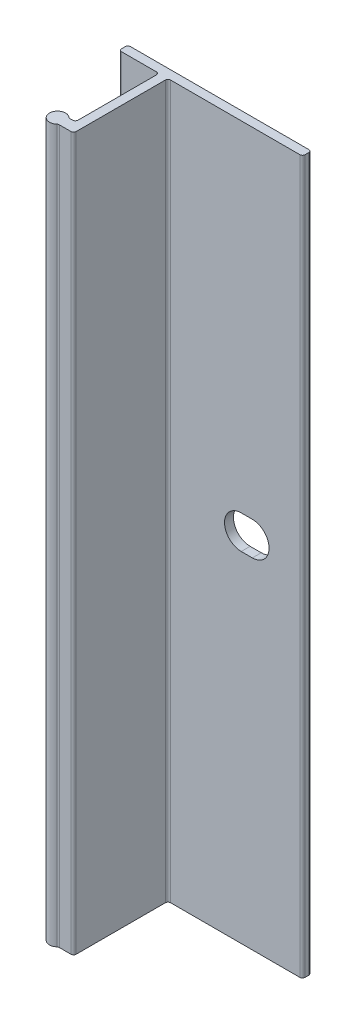
ISO-10303-21;
HEADER;
FILE_DESCRIPTION(('STEP AP214'),'2;1');
FILE_NAME('part.step','',(''),(''),'','','');
FILE_SCHEMA(('AUTOMOTIVE_DESIGN { 1 0 10303 214 1 1 1 1 }'));
ENDSEC;
DATA;
#1=APPLICATION_CONTEXT('core data for automotive mechanical design processes');
#2=APPLICATION_PROTOCOL_DEFINITION('international standard','automotive_design',2000,#1);
#3=PRODUCT_CONTEXT('',#1,'mechanical');
#4=PRODUCT('Part','Part','',(#3));
#5=PRODUCT_RELATED_PRODUCT_CATEGORY('part','',(#4));
#6=PRODUCT_DEFINITION_FORMATION('','',#4);
#7=PRODUCT_DEFINITION_CONTEXT('part definition',#1,'design');
#8=PRODUCT_DEFINITION('design','',#6,#7);
#9=PRODUCT_DEFINITION_SHAPE('','',#8);
#10=(LENGTH_UNIT() NAMED_UNIT(*) SI_UNIT(.MILLI.,.METRE.));
#11=(NAMED_UNIT(*) PLANE_ANGLE_UNIT() SI_UNIT($,.RADIAN.));
#12=(NAMED_UNIT(*) SI_UNIT($,.STERADIAN.) SOLID_ANGLE_UNIT());
#13=UNCERTAINTY_MEASURE_WITH_UNIT(LENGTH_MEASURE(1.E-05),#10,'distance_accuracy_value','');
#14=(GEOMETRIC_REPRESENTATION_CONTEXT(3) GLOBAL_UNCERTAINTY_ASSIGNED_CONTEXT((#13)) GLOBAL_UNIT_ASSIGNED_CONTEXT((#10,
#11,#12)) REPRESENTATION_CONTEXT('',''));
#15=CARTESIAN_POINT('',(0.,0.,0.));
#16=DIRECTION('',(0.,0.,1.));
#17=DIRECTION('',(1.,0.,0.));
#18=AXIS2_PLACEMENT_3D('',#15,#16,#17);
#19=CARTESIAN_POINT('',(-5.33400000000001,50.8,0.381));
#20=DIRECTION('',(0.,-1.,0.));
#21=DIRECTION('',(0.,0.,-1.));
#22=AXIS2_PLACEMENT_3D('',#19,#20,#21);
#23=CYLINDRICAL_SURFACE('',#22,0.381);
#24=CARTESIAN_POINT('',(-5.33400000000001,-50.8,0.381));
#25=DIRECTION('',(0.,1.,0.));
#26=DIRECTION('',(0.,0.,-1.));
#27=AXIS2_PLACEMENT_3D('',#24,#25,#26);
#28=CIRCLE('',#27,0.381);
#29=CARTESIAN_POINT('',(-5.33400000000001,-50.8,0.));
#30=VERTEX_POINT('',#29);
#31=CARTESIAN_POINT('',(-5.71500000000001,-50.8,0.381));
#32=VERTEX_POINT('',#31);
#33=EDGE_CURVE('E227',#30,#32,#28,.T.);
#34=ORIENTED_EDGE('',*,*,#33,.T.);
#35=DIRECTION('',(0.,-1.,0.));
#36=VECTOR('',#35,1.);
#37=CARTESIAN_POINT('',(-5.71500000000001,50.8,0.381));
#38=LINE('',#37,#36);
#39=CARTESIAN_POINT('',(-5.71500000000001,50.8,0.381));
#40=VERTEX_POINT('',#39);
#41=EDGE_CURVE('E11',#40,#32,#38,.T.);
#42=ORIENTED_EDGE('',*,*,#41,.F.);
#43=CARTESIAN_POINT('',(-5.33400000000001,50.8,0.381));
#44=DIRECTION('',(0.,1.,0.));
#45=DIRECTION('',(0.,0.,-1.));
#46=AXIS2_PLACEMENT_3D('',#43,#44,#45);
#47=CIRCLE('',#46,0.381);
#48=CARTESIAN_POINT('',(-5.33400000000001,50.8,0.));
#49=VERTEX_POINT('',#48);
#50=EDGE_CURVE('E231',#49,#40,#47,.T.);
#51=ORIENTED_EDGE('',*,*,#50,.F.);
#52=DIRECTION('',(0.,-1.,0.));
#53=VECTOR('',#52,1.);
#54=CARTESIAN_POINT('',(-5.33400000000001,50.8,0.));
#55=LINE('',#54,#53);
#56=EDGE_CURVE('E273',#49,#30,#55,.T.);
#57=ORIENTED_EDGE('',*,*,#56,.T.);
#58=EDGE_LOOP('',(#34,#42,#51,#57));
#59=FACE_BOUND('',#58,.T.);
#60=ADVANCED_FACE('F34',(#59),#23,.T.);
#61=CARTESIAN_POINT('',(-5.71500000000001,50.8,0.889000000000005));
#62=DIRECTION('',(1.,0.,0.));
#63=DIRECTION('',(0.,0.,-1.));
#64=AXIS2_PLACEMENT_3D('',#61,#62,#63);
#65=PLANE('',#64);
#66=DIRECTION('',(0.,0.,1.));
#67=VECTOR('',#66,1.);
#68=CARTESIAN_POINT('',(-5.71500000000001,-50.8,0.889000000000005));
#69=LINE('',#68,#67);
#70=CARTESIAN_POINT('',(-5.71500000000001,-50.8,0.889000000000005));
#71=VERTEX_POINT('',#70);
#72=EDGE_CURVE('E276',#32,#71,#69,.T.);
#73=ORIENTED_EDGE('',*,*,#72,.T.);
#74=DIRECTION('',(0.,-1.,0.));
#75=VECTOR('',#74,1.);
#76=CARTESIAN_POINT('',(-5.71500000000001,50.8,0.889000000000005));
#77=LINE('',#76,#75);
#78=CARTESIAN_POINT('',(-5.71500000000001,50.8,0.889000000000005));
#79=VERTEX_POINT('',#78);
#80=EDGE_CURVE('E41',#79,#71,#77,.T.);
#81=ORIENTED_EDGE('',*,*,#80,.F.);
#82=DIRECTION('',(0.,0.,1.));
#83=VECTOR('',#82,1.);
#84=CARTESIAN_POINT('',(-5.71500000000001,50.8,0.889000000000005));
#85=LINE('',#84,#83);
#86=EDGE_CURVE('E234',#40,#79,#85,.T.);
#87=ORIENTED_EDGE('',*,*,#86,.F.);
#88=ORIENTED_EDGE('',*,*,#41,.T.);
#89=EDGE_LOOP('',(#73,#81,#87,#88));
#90=FACE_BOUND('',#89,.T.);
#91=ADVANCED_FACE('F393',(#90),#65,.F.);
#92=CARTESIAN_POINT('',(-5.33400000000001,50.8,0.889000000000004));
#93=DIRECTION('',(0.,-1.,0.));
#94=DIRECTION('',(0.,0.,-1.));
#95=AXIS2_PLACEMENT_3D('',#92,#93,#94);
#96=CYLINDRICAL_SURFACE('',#95,0.381);
#97=CARTESIAN_POINT('',(-5.33400000000001,-50.8,0.889000000000004));
#98=DIRECTION('',(0.,1.,0.));
#99=DIRECTION('',(0.,0.,-1.));
#100=AXIS2_PLACEMENT_3D('',#97,#98,#99);
#101=CIRCLE('',#100,0.381);
#102=CARTESIAN_POINT('',(-5.33400000000001,-50.8,1.27));
#103=VERTEX_POINT('',#102);
#104=EDGE_CURVE('E278',#71,#103,#101,.T.);
#105=ORIENTED_EDGE('',*,*,#104,.T.);
#106=DIRECTION('',(0.,-1.,0.));
#107=VECTOR('',#106,1.);
#108=CARTESIAN_POINT('',(-5.33400000000001,50.8,1.27));
#109=LINE('',#108,#107);
#110=CARTESIAN_POINT('',(-5.33400000000001,50.8,1.27));
#111=VERTEX_POINT('',#110);
#112=EDGE_CURVE('E363',#111,#103,#109,.T.);
#113=ORIENTED_EDGE('',*,*,#112,.F.);
#114=CARTESIAN_POINT('',(-5.33400000000001,50.8,0.889000000000004));
#115=DIRECTION('',(0.,1.,0.));
#116=DIRECTION('',(0.,0.,-1.));
#117=AXIS2_PLACEMENT_3D('',#114,#115,#116);
#118=CIRCLE('',#117,0.381);
#119=EDGE_CURVE('E237',#79,#111,#118,.T.);
#120=ORIENTED_EDGE('',*,*,#119,.F.);
#121=ORIENTED_EDGE('',*,*,#80,.T.);
#122=EDGE_LOOP('',(#105,#113,#120,#121));
#123=FACE_BOUND('',#122,.T.);
#124=ADVANCED_FACE('F370',(#123),#96,.T.);
#125=CARTESIAN_POINT('',(-0.381,50.8,1.27));
#126=DIRECTION('',(0.,0.,-1.));
#127=DIRECTION('',(-1.,0.,0.));
#128=AXIS2_PLACEMENT_3D('',#125,#126,#127);
#129=PLANE('',#128);
#130=DIRECTION('',(1.,0.,0.));
#131=VECTOR('',#130,1.);
#132=CARTESIAN_POINT('',(-0.381,-50.8,1.27));
#133=LINE('',#132,#131);
#134=CARTESIAN_POINT('',(-0.381,-50.8,1.27));
#135=VERTEX_POINT('',#134);
#136=EDGE_CURVE('E280',#103,#135,#133,.T.);
#137=ORIENTED_EDGE('',*,*,#136,.T.);
#138=DIRECTION('',(0.,-1.,0.));
#139=VECTOR('',#138,1.);
#140=CARTESIAN_POINT('',(-0.381,50.8,1.27));
#141=LINE('',#140,#139);
#142=CARTESIAN_POINT('',(-0.381,50.8,1.27));
#143=VERTEX_POINT('',#142);
#144=EDGE_CURVE('E360',#143,#135,#141,.T.);
#145=ORIENTED_EDGE('',*,*,#144,.F.);
#146=DIRECTION('',(1.,0.,0.));
#147=VECTOR('',#146,1.);
#148=CARTESIAN_POINT('',(-0.381,50.8,1.27));
#149=LINE('',#148,#147);
#150=EDGE_CURVE('E239',#111,#143,#149,.T.);
#151=ORIENTED_EDGE('',*,*,#150,.F.);
#152=ORIENTED_EDGE('',*,*,#112,.T.);
#153=EDGE_LOOP('',(#137,#145,#151,#152));
#154=FACE_BOUND('',#153,.T.);
#155=ADVANCED_FACE('F381',(#154),#129,.F.);
#156=CARTESIAN_POINT('',(-0.381,50.8,1.651));
#157=DIRECTION('',(0.,-1.,0.));
#158=DIRECTION('',(0.,0.,-1.));
#159=AXIS2_PLACEMENT_3D('',#156,#157,#158);
#160=CYLINDRICAL_SURFACE('',#159,0.381);
#161=CARTESIAN_POINT('',(-0.381,-50.8,1.651));
#162=DIRECTION('',(0.,-1.,0.));
#163=DIRECTION('',(0.,0.,-1.));
#164=AXIS2_PLACEMENT_3D('',#161,#162,#163);
#165=CIRCLE('',#164,0.381);
#166=CARTESIAN_POINT('',(0.,-50.8,1.651));
#167=VERTEX_POINT('',#166);
#168=EDGE_CURVE('E282',#135,#167,#165,.T.);
#169=ORIENTED_EDGE('',*,*,#168,.T.);
#170=DIRECTION('',(0.,-1.,0.));
#171=VECTOR('',#170,1.);
#172=CARTESIAN_POINT('',(0.,50.8,1.651));
#173=LINE('',#172,#171);
#174=CARTESIAN_POINT('',(0.,50.8,1.651));
#175=VERTEX_POINT('',#174);
#176=EDGE_CURVE('E357',#175,#167,#173,.T.);
#177=ORIENTED_EDGE('',*,*,#176,.F.);
#178=CARTESIAN_POINT('',(-0.381,50.8,1.651));
#179=DIRECTION('',(0.,-1.,0.));
#180=DIRECTION('',(0.,0.,-1.));
#181=AXIS2_PLACEMENT_3D('',#178,#179,#180);
#182=CIRCLE('',#181,0.381);
#183=EDGE_CURVE('E241',#143,#175,#182,.T.);
#184=ORIENTED_EDGE('',*,*,#183,.F.);
#185=ORIENTED_EDGE('',*,*,#144,.T.);
#186=EDGE_LOOP('',(#169,#177,#184,#185));
#187=FACE_BOUND('',#186,.T.);
#188=ADVANCED_FACE('F385',(#187),#160,.F.);
#189=CARTESIAN_POINT('',(0.,50.8,1.651));
#190=DIRECTION('',(1.,0.,0.));
#191=DIRECTION('',(0.,0.,-1.));
#192=AXIS2_PLACEMENT_3D('',#189,#190,#191);
#193=PLANE('',#192);
#194=DIRECTION('',(0.,0.,1.));
#195=VECTOR('',#194,1.);
#196=CARTESIAN_POINT('',(0.,-50.8,1.651));
#197=LINE('',#196,#195);
#198=CARTESIAN_POINT('',(0.,-50.8,12.827));
#199=VERTEX_POINT('',#198);
#200=EDGE_CURVE('E284',#167,#199,#197,.T.);
#201=ORIENTED_EDGE('',*,*,#200,.T.);
#202=DIRECTION('',(0.,-1.,0.));
#203=VECTOR('',#202,1.);
#204=CARTESIAN_POINT('',(0.,50.8,12.827));
#205=LINE('',#204,#203);
#206=CARTESIAN_POINT('',(0.,50.8,12.827));
#207=VERTEX_POINT('',#206);
#208=EDGE_CURVE('E354',#207,#199,#205,.T.);
#209=ORIENTED_EDGE('',*,*,#208,.F.);
#210=DIRECTION('',(0.,0.,1.));
#211=VECTOR('',#210,1.);
#212=CARTESIAN_POINT('',(0.,50.8,1.651));
#213=LINE('',#212,#211);
#214=EDGE_CURVE('E243',#175,#207,#213,.T.);
#215=ORIENTED_EDGE('',*,*,#214,.F.);
#216=ORIENTED_EDGE('',*,*,#176,.T.);
#217=EDGE_LOOP('',(#201,#209,#215,#216));
#218=FACE_BOUND('',#217,.T.);
#219=ADVANCED_FACE('F464',(#218),#193,.F.);
#220=CARTESIAN_POINT('',(-0.380999999999999,50.8,12.827));
#221=DIRECTION('',(0.,-1.,0.));
#222=DIRECTION('',(0.,0.,-1.));
#223=AXIS2_PLACEMENT_3D('',#220,#221,#222);
#224=CYLINDRICAL_SURFACE('',#223,0.381);
#225=CARTESIAN_POINT('',(-0.380999999999999,-50.8,12.827));
#226=DIRECTION('',(0.,-1.,0.));
#227=DIRECTION('',(0.,0.,-1.));
#228=AXIS2_PLACEMENT_3D('',#225,#226,#227);
#229=CIRCLE('',#228,0.381);
#230=CARTESIAN_POINT('',(-0.380999999999999,-50.8,13.208));
#231=VERTEX_POINT('',#230);
#232=EDGE_CURVE('E286',#199,#231,#229,.T.);
#233=ORIENTED_EDGE('',*,*,#232,.T.);
#234=DIRECTION('',(0.,-1.,0.));
#235=VECTOR('',#234,1.);
#236=CARTESIAN_POINT('',(-0.380999999999999,50.8,13.208));
#237=LINE('',#236,#235);
#238=CARTESIAN_POINT('',(-0.380999999999999,50.8,13.208));
#239=VERTEX_POINT('',#238);
#240=EDGE_CURVE('E351',#239,#231,#237,.T.);
#241=ORIENTED_EDGE('',*,*,#240,.F.);
#242=CARTESIAN_POINT('',(-0.380999999999999,50.8,12.827));
#243=DIRECTION('',(0.,-1.,0.));
#244=DIRECTION('',(0.,0.,-1.));
#245=AXIS2_PLACEMENT_3D('',#242,#243,#244);
#246=CIRCLE('',#245,0.381);
#247=EDGE_CURVE('E245',#207,#239,#246,.T.);
#248=ORIENTED_EDGE('',*,*,#247,.F.);
#249=ORIENTED_EDGE('',*,*,#208,.T.);
#250=EDGE_LOOP('',(#233,#241,#248,#249));
#251=FACE_BOUND('',#250,.T.);
#252=ADVANCED_FACE('F462',(#251),#224,.F.);
#253=CARTESIAN_POINT('',(-0.769968750484389,50.8,13.208));
#254=DIRECTION('',(0.,0.,1.));
#255=DIRECTION('',(1.,0.,0.));
#256=AXIS2_PLACEMENT_3D('',#253,#254,#255);
#257=PLANE('',#256);
#258=DIRECTION('',(-1.,0.,0.));
#259=VECTOR('',#258,1.);
#260=CARTESIAN_POINT('',(-0.769968750484389,-50.8,13.208));
#261=LINE('',#260,#259);
#262=CARTESIAN_POINT('',(-0.769968750484389,-50.8,13.208));
#263=VERTEX_POINT('',#262);
#264=EDGE_CURVE('E288',#231,#263,#261,.T.);
#265=ORIENTED_EDGE('',*,*,#264,.T.);
#266=DIRECTION('',(0.,-1.,0.));
#267=VECTOR('',#266,1.);
#268=CARTESIAN_POINT('',(-0.769968750484389,50.8,13.208));
#269=LINE('',#268,#267);
#270=CARTESIAN_POINT('',(-0.769968750484389,50.8,13.208));
#271=VERTEX_POINT('',#270);
#272=EDGE_CURVE('E348',#271,#263,#269,.T.);
#273=ORIENTED_EDGE('',*,*,#272,.F.);
#274=DIRECTION('',(-1.,0.,0.));
#275=VECTOR('',#274,1.);
#276=CARTESIAN_POINT('',(-0.769968750484389,50.8,13.208));
#277=LINE('',#276,#275);
#278=EDGE_CURVE('E247',#239,#271,#277,.T.);
#279=ORIENTED_EDGE('',*,*,#278,.F.);
#280=ORIENTED_EDGE('',*,*,#240,.T.);
#281=EDGE_LOOP('',(#265,#273,#279,#280));
#282=FACE_BOUND('',#281,.T.);
#283=ADVANCED_FACE('F457',(#282),#257,.F.);
#284=CARTESIAN_POINT('',(-0.769968750484389,50.8,12.827));
#285=DIRECTION('',(0.,-1.,0.));
#286=DIRECTION('',(0.,0.,-1.));
#287=AXIS2_PLACEMENT_3D('',#284,#285,#286);
#288=CYLINDRICAL_SURFACE('',#287,0.381);
#289=CARTESIAN_POINT('',(-0.769968750484389,-50.8,12.827));
#290=DIRECTION('',(0.,-1.,0.));
#291=DIRECTION('',(0.,0.,-1.));
#292=AXIS2_PLACEMENT_3D('',#289,#290,#291);
#293=CIRCLE('',#292,0.381);
#294=CARTESIAN_POINT('',(-1.02197656286329,-50.8,13.11275));
#295=VERTEX_POINT('',#294);
#296=EDGE_CURVE('E290',#263,#295,#293,.T.);
#297=ORIENTED_EDGE('',*,*,#296,.T.);
#298=DIRECTION('',(0.,-1.,0.));
#299=VECTOR('',#298,1.);
#300=CARTESIAN_POINT('',(-1.02197656286329,50.8,13.11275));
#301=LINE('',#300,#299);
#302=CARTESIAN_POINT('',(-1.02197656286329,50.8,13.11275));
#303=VERTEX_POINT('',#302);
#304=EDGE_CURVE('E345',#303,#295,#301,.T.);
#305=ORIENTED_EDGE('',*,*,#304,.F.);
#306=CARTESIAN_POINT('',(-0.769968750484389,50.8,12.827));
#307=DIRECTION('',(0.,-1.,0.));
#308=DIRECTION('',(0.,0.,-1.));
#309=AXIS2_PLACEMENT_3D('',#306,#307,#308);
#310=CIRCLE('',#309,0.381);
#311=EDGE_CURVE('E249',#271,#303,#310,.T.);
#312=ORIENTED_EDGE('',*,*,#311,.F.);
#313=ORIENTED_EDGE('',*,*,#272,.T.);
#314=EDGE_LOOP('',(#297,#305,#312,#313));
#315=FACE_BOUND('',#314,.T.);
#316=ADVANCED_FACE('F452',(#315),#288,.F.);
#317=CARTESIAN_POINT('',(-1.778,50.8,13.97));
#318=DIRECTION('',(0.,-1.,0.));
#319=DIRECTION('',(0.,0.,-1.));
#320=AXIS2_PLACEMENT_3D('',#317,#318,#319);
#321=CYLINDRICAL_SURFACE('',#320,1.143);
#322=CARTESIAN_POINT('',(-1.778,-50.8,13.97));
#323=DIRECTION('',(0.,1.,0.));
#324=DIRECTION('',(0.,0.,1.));
#325=AXIS2_PLACEMENT_3D('',#322,#323,#324);
#326=CIRCLE('',#325,1.143);
#327=CARTESIAN_POINT('',(-1.02197656286329,-50.8,14.82725));
#328=VERTEX_POINT('',#327);
#329=EDGE_CURVE('E292',#295,#328,#326,.T.);
#330=ORIENTED_EDGE('',*,*,#329,.T.);
#331=DIRECTION('',(0.,-1.,0.));
#332=VECTOR('',#331,1.);
#333=CARTESIAN_POINT('',(-1.02197656286329,50.8,14.82725));
#334=LINE('',#333,#332);
#335=CARTESIAN_POINT('',(-1.02197656286329,50.8,14.82725));
#336=VERTEX_POINT('',#335);
#337=EDGE_CURVE('E342',#336,#328,#334,.T.);
#338=ORIENTED_EDGE('',*,*,#337,.F.);
#339=CARTESIAN_POINT('',(-1.778,50.8,13.97));
#340=DIRECTION('',(0.,1.,0.));
#341=DIRECTION('',(0.,0.,1.));
#342=AXIS2_PLACEMENT_3D('',#339,#340,#341);
#343=CIRCLE('',#342,1.143);
#344=EDGE_CURVE('E251',#303,#336,#343,.T.);
#345=ORIENTED_EDGE('',*,*,#344,.F.);
#346=ORIENTED_EDGE('',*,*,#304,.T.);
#347=EDGE_LOOP('',(#330,#338,#345,#346));
#348=FACE_BOUND('',#347,.T.);
#349=ADVANCED_FACE('F448',(#348),#321,.T.);
#350=CARTESIAN_POINT('',(-0.769968750484387,50.8,15.113));
#351=DIRECTION('',(0.,-1.,0.));
#352=DIRECTION('',(0.,0.,-1.));
#353=AXIS2_PLACEMENT_3D('',#350,#351,#352);
#354=CYLINDRICAL_SURFACE('',#353,0.381);
#355=CARTESIAN_POINT('',(-0.769968750484387,-50.8,15.113));
#356=DIRECTION('',(0.,-1.,0.));
#357=DIRECTION('',(0.,0.,1.));
#358=AXIS2_PLACEMENT_3D('',#355,#356,#357);
#359=CIRCLE('',#358,0.381);
#360=CARTESIAN_POINT('',(-0.769968750484387,-50.8,14.732));
#361=VERTEX_POINT('',#360);
#362=EDGE_CURVE('E294',#328,#361,#359,.T.);
#363=ORIENTED_EDGE('',*,*,#362,.T.);
#364=DIRECTION('',(0.,-1.,0.));
#365=VECTOR('',#364,1.);
#366=CARTESIAN_POINT('',(-0.769968750484387,50.8,14.732));
#367=LINE('',#366,#365);
#368=CARTESIAN_POINT('',(-0.769968750484387,50.8,14.732));
#369=VERTEX_POINT('',#368);
#370=EDGE_CURVE('E339',#369,#361,#367,.T.);
#371=ORIENTED_EDGE('',*,*,#370,.F.);
#372=CARTESIAN_POINT('',(-0.769968750484387,50.8,15.113));
#373=DIRECTION('',(0.,-1.,0.));
#374=DIRECTION('',(0.,0.,1.));
#375=AXIS2_PLACEMENT_3D('',#372,#373,#374);
#376=CIRCLE('',#375,0.381);
#377=EDGE_CURVE('E253',#336,#369,#376,.T.);
#378=ORIENTED_EDGE('',*,*,#377,.F.);
#379=ORIENTED_EDGE('',*,*,#337,.T.);
#380=EDGE_LOOP('',(#363,#371,#378,#379));
#381=FACE_BOUND('',#380,.T.);
#382=ADVANCED_FACE('F443',(#381),#354,.F.);
#383=CARTESIAN_POINT('',(-0.769968750484387,50.8,14.732));
#384=DIRECTION('',(0.,0.,-1.));
#385=DIRECTION('',(-1.,0.,0.));
#386=AXIS2_PLACEMENT_3D('',#383,#384,#385);
#387=PLANE('',#386);
#388=DIRECTION('',(1.,0.,0.));
#389=VECTOR('',#388,1.);
#390=CARTESIAN_POINT('',(-0.769968750484387,-50.8,14.732));
#391=LINE('',#390,#389);
#392=CARTESIAN_POINT('',(0.889000000000001,-50.8,14.732));
#393=VERTEX_POINT('',#392);
#394=EDGE_CURVE('E296',#361,#393,#391,.T.);
#395=ORIENTED_EDGE('',*,*,#394,.T.);
#396=DIRECTION('',(0.,-1.,0.));
#397=VECTOR('',#396,1.);
#398=CARTESIAN_POINT('',(0.889000000000001,50.8,14.732));
#399=LINE('',#398,#397);
#400=CARTESIAN_POINT('',(0.889000000000001,50.8,14.732));
#401=VERTEX_POINT('',#400);
#402=EDGE_CURVE('E336',#401,#393,#399,.T.);
#403=ORIENTED_EDGE('',*,*,#402,.F.);
#404=DIRECTION('',(1.,0.,0.));
#405=VECTOR('',#404,1.);
#406=CARTESIAN_POINT('',(-0.769968750484387,50.8,14.732));
#407=LINE('',#406,#405);
#408=EDGE_CURVE('E255',#369,#401,#407,.T.);
#409=ORIENTED_EDGE('',*,*,#408,.F.);
#410=ORIENTED_EDGE('',*,*,#370,.T.);
#411=EDGE_LOOP('',(#395,#403,#409,#410));
#412=FACE_BOUND('',#411,.T.);
#413=ADVANCED_FACE('F437',(#412),#387,.F.);
#414=CARTESIAN_POINT('',(0.889000000000001,50.8,14.351));
#415=DIRECTION('',(0.,-1.,0.));
#416=DIRECTION('',(0.,0.,-1.));
#417=AXIS2_PLACEMENT_3D('',#414,#415,#416);
#418=CYLINDRICAL_SURFACE('',#417,0.381);
#419=CARTESIAN_POINT('',(0.889000000000001,-50.8,14.351));
#420=DIRECTION('',(0.,1.,0.));
#421=DIRECTION('',(0.,0.,1.));
#422=AXIS2_PLACEMENT_3D('',#419,#420,#421);
#423=CIRCLE('',#422,0.381);
#424=CARTESIAN_POINT('',(1.27,-50.8,14.351));
#425=VERTEX_POINT('',#424);
#426=EDGE_CURVE('E298',#393,#425,#423,.T.);
#427=ORIENTED_EDGE('',*,*,#426,.T.);
#428=DIRECTION('',(0.,-1.,0.));
#429=VECTOR('',#428,1.);
#430=CARTESIAN_POINT('',(1.27,50.8,14.351));
#431=LINE('',#430,#429);
#432=CARTESIAN_POINT('',(1.27,50.8,14.351));
#433=VERTEX_POINT('',#432);
#434=EDGE_CURVE('E333',#433,#425,#431,.T.);
#435=ORIENTED_EDGE('',*,*,#434,.F.);
#436=CARTESIAN_POINT('',(0.889000000000001,50.8,14.351));
#437=DIRECTION('',(0.,1.,0.));
#438=DIRECTION('',(0.,0.,1.));
#439=AXIS2_PLACEMENT_3D('',#436,#437,#438);
#440=CIRCLE('',#439,0.381);
#441=EDGE_CURVE('E257',#401,#433,#440,.T.);
#442=ORIENTED_EDGE('',*,*,#441,.F.);
#443=ORIENTED_EDGE('',*,*,#402,.T.);
#444=EDGE_LOOP('',(#427,#435,#442,#443));
#445=FACE_BOUND('',#444,.T.);
#446=ADVANCED_FACE('F433',(#445),#418,.T.);
#447=CARTESIAN_POINT('',(1.27,50.8,1.651));
#448=DIRECTION('',(-1.,0.,0.));
#449=DIRECTION('',(0.,0.,1.));
#450=AXIS2_PLACEMENT_3D('',#447,#448,#449);
#451=PLANE('',#450);
#452=DIRECTION('',(0.,0.,-1.));
#453=VECTOR('',#452,1.);
#454=CARTESIAN_POINT('',(1.27,-50.8,1.651));
#455=LINE('',#454,#453);
#456=CARTESIAN_POINT('',(1.27,-50.8,1.651));
#457=VERTEX_POINT('',#456);
#458=EDGE_CURVE('E300',#425,#457,#455,.T.);
#459=ORIENTED_EDGE('',*,*,#458,.T.);
#460=DIRECTION('',(0.,-1.,0.));
#461=VECTOR('',#460,1.);
#462=CARTESIAN_POINT('',(1.27,50.8,1.651));
#463=LINE('',#462,#461);
#464=CARTESIAN_POINT('',(1.27,50.8,1.651));
#465=VERTEX_POINT('',#464);
#466=EDGE_CURVE('E330',#465,#457,#463,.T.);
#467=ORIENTED_EDGE('',*,*,#466,.F.);
#468=DIRECTION('',(0.,0.,-1.));
#469=VECTOR('',#468,1.);
#470=CARTESIAN_POINT('',(1.27,50.8,1.651));
#471=LINE('',#470,#469);
#472=EDGE_CURVE('E259',#433,#465,#471,.T.);
#473=ORIENTED_EDGE('',*,*,#472,.F.);
#474=ORIENTED_EDGE('',*,*,#434,.T.);
#475=EDGE_LOOP('',(#459,#467,#473,#474));
#476=FACE_BOUND('',#475,.T.);
#477=ADVANCED_FACE('F428',(#476),#451,.F.);
#478=CARTESIAN_POINT('',(1.651,50.8,1.651));
#479=DIRECTION('',(0.,-1.,0.));
#480=DIRECTION('',(0.,0.,-1.));
#481=AXIS2_PLACEMENT_3D('',#478,#479,#480);
#482=CYLINDRICAL_SURFACE('',#481,0.381);
#483=CARTESIAN_POINT('',(1.651,-50.8,1.651));
#484=DIRECTION('',(0.,-1.,0.));
#485=DIRECTION('',(0.,0.,1.));
#486=AXIS2_PLACEMENT_3D('',#483,#484,#485);
#487=CIRCLE('',#486,0.381);
#488=CARTESIAN_POINT('',(1.651,-50.8,1.27));
#489=VERTEX_POINT('',#488);
#490=EDGE_CURVE('E302',#457,#489,#487,.T.);
#491=ORIENTED_EDGE('',*,*,#490,.T.);
#492=DIRECTION('',(0.,-1.,0.));
#493=VECTOR('',#492,1.);
#494=CARTESIAN_POINT('',(1.651,50.8,1.27));
#495=LINE('',#494,#493);
#496=CARTESIAN_POINT('',(1.651,50.8,1.27));
#497=VERTEX_POINT('',#496);
#498=EDGE_CURVE('E327',#497,#489,#495,.T.);
#499=ORIENTED_EDGE('',*,*,#498,.F.);
#500=CARTESIAN_POINT('',(1.651,50.8,1.651));
#501=DIRECTION('',(0.,-1.,0.));
#502=DIRECTION('',(0.,0.,1.));
#503=AXIS2_PLACEMENT_3D('',#500,#501,#502);
#504=CIRCLE('',#503,0.381);
#505=EDGE_CURVE('E261',#465,#497,#504,.T.);
#506=ORIENTED_EDGE('',*,*,#505,.F.);
#507=ORIENTED_EDGE('',*,*,#466,.T.);
#508=EDGE_LOOP('',(#491,#499,#506,#507));
#509=FACE_BOUND('',#508,.T.);
#510=ADVANCED_FACE('F422',(#509),#482,.F.);
#511=CARTESIAN_POINT('',(20.066,50.8,1.27));
#512=DIRECTION('',(0.,0.,-1.));
#513=DIRECTION('',(-1.,0.,0.));
#514=AXIS2_PLACEMENT_3D('',#511,#512,#513);
#515=PLANE('',#514);
#516=DIRECTION('',(1.,0.,0.));
#517=VECTOR('',#516,1.);
#518=CARTESIAN_POINT('',(11.71575,-2.38125,1.27));
#519=LINE('',#518,#517);
#520=CARTESIAN_POINT('',(11.71575,-2.38125,1.27));
#521=VERTEX_POINT('',#520);
#522=CARTESIAN_POINT('',(13.30325,-2.38125,1.27));
#523=VERTEX_POINT('',#522);
#524=EDGE_CURVE('E221',#521,#523,#519,.T.);
#525=ORIENTED_EDGE('',*,*,#524,.F.);
#526=CARTESIAN_POINT('',(11.71575,0.,1.27));
#527=DIRECTION('',(0.,0.,1.));
#528=DIRECTION('',(1.,0.,0.));
#529=AXIS2_PLACEMENT_3D('',#526,#527,#528);
#530=CIRCLE('',#529,2.38125);
#531=CARTESIAN_POINT('',(11.71575,2.38125,1.27));
#532=VERTEX_POINT('',#531);
#533=EDGE_CURVE('E48',#532,#521,#530,.T.);
#534=ORIENTED_EDGE('',*,*,#533,.F.);
#535=DIRECTION('',(-1.,0.,0.));
#536=VECTOR('',#535,1.);
#537=CARTESIAN_POINT('',(11.71575,2.38125,1.27));
#538=LINE('',#537,#536);
#539=CARTESIAN_POINT('',(13.30325,2.38125,1.27));
#540=VERTEX_POINT('',#539);
#541=EDGE_CURVE('E212',#540,#532,#538,.T.);
#542=ORIENTED_EDGE('',*,*,#541,.F.);
#543=CARTESIAN_POINT('',(13.30325,0.,1.27));
#544=DIRECTION('',(0.,0.,1.));
#545=DIRECTION('',(1.,0.,0.));
#546=AXIS2_PLACEMENT_3D('',#543,#544,#545);
#547=CIRCLE('',#546,2.38125);
#548=EDGE_CURVE('E215',#523,#540,#547,.T.);
#549=ORIENTED_EDGE('',*,*,#548,.F.);
#550=EDGE_LOOP('',(#525,#534,#542,#549));
#551=FACE_BOUND('',#550,.T.);
#552=DIRECTION('',(1.,0.,0.));
#553=VECTOR('',#552,1.);
#554=CARTESIAN_POINT('',(20.066,-50.8,1.27));
#555=LINE('',#554,#553);
#556=CARTESIAN_POINT('',(20.066,-50.8,1.27));
#557=VERTEX_POINT('',#556);
#558=EDGE_CURVE('E304',#489,#557,#555,.T.);
#559=ORIENTED_EDGE('',*,*,#558,.T.);
#560=DIRECTION('',(0.,-1.,0.));
#561=VECTOR('',#560,1.);
#562=CARTESIAN_POINT('',(20.066,50.8,1.27));
#563=LINE('',#562,#561);
#564=CARTESIAN_POINT('',(20.066,50.8,1.27));
#565=VERTEX_POINT('',#564);
#566=EDGE_CURVE('E324',#565,#557,#563,.T.);
#567=ORIENTED_EDGE('',*,*,#566,.F.);
#568=DIRECTION('',(1.,0.,0.));
#569=VECTOR('',#568,1.);
#570=CARTESIAN_POINT('',(20.066,50.8,1.27));
#571=LINE('',#570,#569);
#572=EDGE_CURVE('E263',#497,#565,#571,.T.);
#573=ORIENTED_EDGE('',*,*,#572,.F.);
#574=ORIENTED_EDGE('',*,*,#498,.T.);
#575=EDGE_LOOP('',(#559,#567,#573,#574));
#576=FACE_BOUND('',#575,.T.);
#577=ADVANCED_FACE('F418',(#551,#576),#515,.F.);
#578=CARTESIAN_POINT('',(20.066,50.8,0.889000000000001));
#579=DIRECTION('',(0.,-1.,0.));
#580=DIRECTION('',(0.,0.,-1.));
#581=AXIS2_PLACEMENT_3D('',#578,#579,#580);
#582=CYLINDRICAL_SURFACE('',#581,0.380999999999998);
#583=CARTESIAN_POINT('',(20.066,-50.8,0.889000000000001));
#584=DIRECTION('',(0.,1.,0.));
#585=DIRECTION('',(0.,0.,-1.));
#586=AXIS2_PLACEMENT_3D('',#583,#584,#585);
#587=CIRCLE('',#586,0.380999999999998);
#588=CARTESIAN_POINT('',(20.447,-50.8,0.889000000000001));
#589=VERTEX_POINT('',#588);
#590=EDGE_CURVE('E306',#557,#589,#587,.T.);
#591=ORIENTED_EDGE('',*,*,#590,.T.);
#592=DIRECTION('',(0.,-1.,0.));
#593=VECTOR('',#592,1.);
#594=CARTESIAN_POINT('',(20.447,50.8,0.889000000000001));
#595=LINE('',#594,#593);
#596=CARTESIAN_POINT('',(20.447,50.8,0.889000000000001));
#597=VERTEX_POINT('',#596);
#598=EDGE_CURVE('E321',#597,#589,#595,.T.);
#599=ORIENTED_EDGE('',*,*,#598,.F.);
#600=CARTESIAN_POINT('',(20.066,50.8,0.889000000000001));
#601=DIRECTION('',(0.,1.,0.));
#602=DIRECTION('',(0.,0.,-1.));
#603=AXIS2_PLACEMENT_3D('',#600,#601,#602);
#604=CIRCLE('',#603,0.380999999999998);
#605=EDGE_CURVE('E265',#565,#597,#604,.T.);
#606=ORIENTED_EDGE('',*,*,#605,.F.);
#607=ORIENTED_EDGE('',*,*,#566,.T.);
#608=EDGE_LOOP('',(#591,#599,#606,#607));
#609=FACE_BOUND('',#608,.T.);
#610=ADVANCED_FACE('F413',(#609),#582,.T.);
#611=CARTESIAN_POINT('',(20.447,50.8,0.381));
#612=DIRECTION('',(-1.,0.,0.));
#613=DIRECTION('',(0.,0.,1.));
#614=AXIS2_PLACEMENT_3D('',#611,#612,#613);
#615=PLANE('',#614);
#616=DIRECTION('',(0.,0.,-1.));
#617=VECTOR('',#616,1.);
#618=CARTESIAN_POINT('',(20.447,-50.8,0.381));
#619=LINE('',#618,#617);
#620=CARTESIAN_POINT('',(20.447,-50.8,0.381));
#621=VERTEX_POINT('',#620);
#622=EDGE_CURVE('E308',#589,#621,#619,.T.);
#623=ORIENTED_EDGE('',*,*,#622,.T.);
#624=DIRECTION('',(0.,-1.,0.));
#625=VECTOR('',#624,1.);
#626=CARTESIAN_POINT('',(20.447,50.8,0.381));
#627=LINE('',#626,#625);
#628=CARTESIAN_POINT('',(20.447,50.8,0.381));
#629=VERTEX_POINT('',#628);
#630=EDGE_CURVE('E318',#629,#621,#627,.T.);
#631=ORIENTED_EDGE('',*,*,#630,.F.);
#632=DIRECTION('',(0.,0.,-1.));
#633=VECTOR('',#632,1.);
#634=CARTESIAN_POINT('',(20.447,50.8,0.381));
#635=LINE('',#634,#633);
#636=EDGE_CURVE('E267',#597,#629,#635,.T.);
#637=ORIENTED_EDGE('',*,*,#636,.F.);
#638=ORIENTED_EDGE('',*,*,#598,.T.);
#639=EDGE_LOOP('',(#623,#631,#637,#638));
#640=FACE_BOUND('',#639,.T.);
#641=ADVANCED_FACE('F407',(#640),#615,.F.);
#642=CARTESIAN_POINT('',(20.066,50.8,0.381));
#643=DIRECTION('',(0.,-1.,0.));
#644=DIRECTION('',(0.,0.,-1.));
#645=AXIS2_PLACEMENT_3D('',#642,#643,#644);
#646=CYLINDRICAL_SURFACE('',#645,0.381);
#647=CARTESIAN_POINT('',(20.066,-50.8,0.381));
#648=DIRECTION('',(0.,1.,0.));
#649=DIRECTION('',(0.,0.,-1.));
#650=AXIS2_PLACEMENT_3D('',#647,#648,#649);
#651=CIRCLE('',#650,0.381);
#652=CARTESIAN_POINT('',(20.066,-50.8,0.));
#653=VERTEX_POINT('',#652);
#654=EDGE_CURVE('E310',#621,#653,#651,.T.);
#655=ORIENTED_EDGE('',*,*,#654,.T.);
#656=DIRECTION('',(0.,-1.,0.));
#657=VECTOR('',#656,1.);
#658=CARTESIAN_POINT('',(20.066,50.8,0.));
#659=LINE('',#658,#657);
#660=CARTESIAN_POINT('',(20.066,50.8,0.));
#661=VERTEX_POINT('',#660);
#662=EDGE_CURVE('E315',#661,#653,#659,.T.);
#663=ORIENTED_EDGE('',*,*,#662,.F.);
#664=CARTESIAN_POINT('',(20.066,50.8,0.381));
#665=DIRECTION('',(0.,1.,0.));
#666=DIRECTION('',(0.,0.,-1.));
#667=AXIS2_PLACEMENT_3D('',#664,#665,#666);
#668=CIRCLE('',#667,0.381);
#669=EDGE_CURVE('E269',#629,#661,#668,.T.);
#670=ORIENTED_EDGE('',*,*,#669,.F.);
#671=ORIENTED_EDGE('',*,*,#630,.T.);
#672=EDGE_LOOP('',(#655,#663,#670,#671));
#673=FACE_BOUND('',#672,.T.);
#674=ADVANCED_FACE('F403',(#673),#646,.T.);
#675=CARTESIAN_POINT('',(-5.33400000000001,50.8,0.));
#676=DIRECTION('',(0.,0.,1.));
#677=DIRECTION('',(1.,0.,0.));
#678=AXIS2_PLACEMENT_3D('',#675,#676,#677);
#679=PLANE('',#678);
#680=DIRECTION('',(-1.,0.,0.));
#681=VECTOR('',#680,1.);
#682=CARTESIAN_POINT('',(11.71575,2.38125,0.));
#683=LINE('',#682,#681);
#684=CARTESIAN_POINT('',(13.30325,2.38125,0.));
#685=VERTEX_POINT('',#684);
#686=CARTESIAN_POINT('',(11.71575,2.38125,0.));
#687=VERTEX_POINT('',#686);
#688=EDGE_CURVE('E202',#685,#687,#683,.T.);
#689=ORIENTED_EDGE('',*,*,#688,.T.);
#690=CARTESIAN_POINT('',(11.71575,0.,0.));
#691=DIRECTION('',(0.,0.,1.));
#692=DIRECTION('',(1.,0.,0.));
#693=AXIS2_PLACEMENT_3D('',#690,#691,#692);
#694=CIRCLE('',#693,2.38125);
#695=CARTESIAN_POINT('',(11.71575,-2.38125,0.));
#696=VERTEX_POINT('',#695);
#697=EDGE_CURVE('E196',#687,#696,#694,.T.);
#698=ORIENTED_EDGE('',*,*,#697,.T.);
#699=DIRECTION('',(1.,0.,0.));
#700=VECTOR('',#699,1.);
#701=CARTESIAN_POINT('',(11.71575,-2.38125,0.));
#702=LINE('',#701,#700);
#703=CARTESIAN_POINT('',(13.30325,-2.38125,0.));
#704=VERTEX_POINT('',#703);
#705=EDGE_CURVE('E205',#696,#704,#702,.T.);
#706=ORIENTED_EDGE('',*,*,#705,.T.);
#707=CARTESIAN_POINT('',(13.30325,0.,0.));
#708=DIRECTION('',(0.,0.,1.));
#709=DIRECTION('',(1.,0.,0.));
#710=AXIS2_PLACEMENT_3D('',#707,#708,#709);
#711=CIRCLE('',#710,2.38125);
#712=EDGE_CURVE('E56',#704,#685,#711,.T.);
#713=ORIENTED_EDGE('',*,*,#712,.T.);
#714=EDGE_LOOP('',(#689,#698,#706,#713));
#715=FACE_BOUND('',#714,.T.);
#716=DIRECTION('',(-1.,0.,0.));
#717=VECTOR('',#716,1.);
#718=CARTESIAN_POINT('',(-5.33400000000001,-50.8,0.));
#719=LINE('',#718,#717);
#720=EDGE_CURVE('E235',#653,#30,#719,.T.);
#721=ORIENTED_EDGE('',*,*,#720,.T.);
#722=ORIENTED_EDGE('',*,*,#56,.F.);
#723=DIRECTION('',(-1.,0.,0.));
#724=VECTOR('',#723,1.);
#725=CARTESIAN_POINT('',(-5.33400000000001,50.8,0.));
#726=LINE('',#725,#724);
#727=EDGE_CURVE('E271',#661,#49,#726,.T.);
#728=ORIENTED_EDGE('',*,*,#727,.F.);
#729=ORIENTED_EDGE('',*,*,#662,.T.);
#730=EDGE_LOOP('',(#721,#722,#728,#729));
#731=FACE_BOUND('',#730,.T.);
#732=ADVANCED_FACE('F209',(#715,#731),#679,.F.);
#733=CARTESIAN_POINT('',(-5.33400000000001,50.8,0.381));
#734=DIRECTION('',(0.,-1.,0.));
#735=DIRECTION('',(0.,0.,-1.));
#736=AXIS2_PLACEMENT_3D('',#733,#734,#735);
#737=PLANE('',#736);
#738=ORIENTED_EDGE('',*,*,#50,.T.);
#739=ORIENTED_EDGE('',*,*,#86,.T.);
#740=ORIENTED_EDGE('',*,*,#119,.T.);
#741=ORIENTED_EDGE('',*,*,#150,.T.);
#742=ORIENTED_EDGE('',*,*,#183,.T.);
#743=ORIENTED_EDGE('',*,*,#214,.T.);
#744=ORIENTED_EDGE('',*,*,#247,.T.);
#745=ORIENTED_EDGE('',*,*,#278,.T.);
#746=ORIENTED_EDGE('',*,*,#311,.T.);
#747=ORIENTED_EDGE('',*,*,#344,.T.);
#748=ORIENTED_EDGE('',*,*,#377,.T.);
#749=ORIENTED_EDGE('',*,*,#408,.T.);
#750=ORIENTED_EDGE('',*,*,#441,.T.);
#751=ORIENTED_EDGE('',*,*,#472,.T.);
#752=ORIENTED_EDGE('',*,*,#505,.T.);
#753=ORIENTED_EDGE('',*,*,#572,.T.);
#754=ORIENTED_EDGE('',*,*,#605,.T.);
#755=ORIENTED_EDGE('',*,*,#636,.T.);
#756=ORIENTED_EDGE('',*,*,#669,.T.);
#757=ORIENTED_EDGE('',*,*,#727,.T.);
#758=EDGE_LOOP('',(#738,#739,#740,#741,#742,#743,#744,#745,#746,#747,#748,#749,#750,#751,#752,
#753,#754,#755,#756,#757));
#759=FACE_BOUND('',#758,.T.);
#760=ADVANCED_FACE('F389',(#759),#737,.F.);
#761=CARTESIAN_POINT('',(-5.33400000000001,-50.8,0.381));
#762=DIRECTION('',(0.,-1.,0.));
#763=DIRECTION('',(0.,0.,-1.));
#764=AXIS2_PLACEMENT_3D('',#761,#762,#763);
#765=PLANE('',#764);
#766=ORIENTED_EDGE('',*,*,#33,.F.);
#767=ORIENTED_EDGE('',*,*,#720,.F.);
#768=ORIENTED_EDGE('',*,*,#654,.F.);
#769=ORIENTED_EDGE('',*,*,#622,.F.);
#770=ORIENTED_EDGE('',*,*,#590,.F.);
#771=ORIENTED_EDGE('',*,*,#558,.F.);
#772=ORIENTED_EDGE('',*,*,#490,.F.);
#773=ORIENTED_EDGE('',*,*,#458,.F.);
#774=ORIENTED_EDGE('',*,*,#426,.F.);
#775=ORIENTED_EDGE('',*,*,#394,.F.);
#776=ORIENTED_EDGE('',*,*,#362,.F.);
#777=ORIENTED_EDGE('',*,*,#329,.F.);
#778=ORIENTED_EDGE('',*,*,#296,.F.);
#779=ORIENTED_EDGE('',*,*,#264,.F.);
#780=ORIENTED_EDGE('',*,*,#232,.F.);
#781=ORIENTED_EDGE('',*,*,#200,.F.);
#782=ORIENTED_EDGE('',*,*,#168,.F.);
#783=ORIENTED_EDGE('',*,*,#136,.F.);
#784=ORIENTED_EDGE('',*,*,#104,.F.);
#785=ORIENTED_EDGE('',*,*,#72,.F.);
#786=EDGE_LOOP('',(#766,#767,#768,#769,#770,#771,#772,#773,#774,#775,#776,#777,#778,#779,#780,
#781,#782,#783,#784,#785));
#787=FACE_BOUND('',#786,.T.);
#788=ADVANCED_FACE('F376',(#787),#765,.T.);
#789=CARTESIAN_POINT('',(11.71575,0.,0.));
#790=DIRECTION('',(0.,0.,1.));
#791=DIRECTION('',(1.,0.,0.));
#792=AXIS2_PLACEMENT_3D('',#789,#790,#791);
#793=CYLINDRICAL_SURFACE('',#792,2.38125);
#794=ORIENTED_EDGE('',*,*,#533,.T.);
#795=DIRECTION('',(0.,0.,1.));
#796=VECTOR('',#795,1.);
#797=CARTESIAN_POINT('',(11.71575,-2.38125,0.));
#798=LINE('',#797,#796);
#799=EDGE_CURVE('E192',#696,#521,#798,.T.);
#800=ORIENTED_EDGE('',*,*,#799,.F.);
#801=ORIENTED_EDGE('',*,*,#697,.F.);
#802=DIRECTION('',(0.,0.,1.));
#803=VECTOR('',#802,1.);
#804=CARTESIAN_POINT('',(11.71575,2.38125,0.));
#805=LINE('',#804,#803);
#806=EDGE_CURVE('E225',#687,#532,#805,.T.);
#807=ORIENTED_EDGE('',*,*,#806,.T.);
#808=EDGE_LOOP('',(#794,#800,#801,#807));
#809=FACE_BOUND('',#808,.T.);
#810=ADVANCED_FACE('F194',(#809),#793,.F.);
#811=CARTESIAN_POINT('',(11.71575,2.38125,0.));
#812=DIRECTION('',(0.,1.,0.));
#813=DIRECTION('',(-1.,0.,0.));
#814=AXIS2_PLACEMENT_3D('',#811,#812,#813);
#815=PLANE('',#814);
#816=ORIENTED_EDGE('',*,*,#541,.T.);
#817=ORIENTED_EDGE('',*,*,#806,.F.);
#818=ORIENTED_EDGE('',*,*,#688,.F.);
#819=DIRECTION('',(0.,0.,1.));
#820=VECTOR('',#819,1.);
#821=CARTESIAN_POINT('',(13.30325,2.38125,0.));
#822=LINE('',#821,#820);
#823=EDGE_CURVE('E228',#685,#540,#822,.T.);
#824=ORIENTED_EDGE('',*,*,#823,.T.);
#825=EDGE_LOOP('',(#816,#817,#818,#824));
#826=FACE_BOUND('',#825,.T.);
#827=ADVANCED_FACE('F631',(#826),#815,.F.);
#828=CARTESIAN_POINT('',(13.30325,0.,0.));
#829=DIRECTION('',(0.,0.,1.));
#830=DIRECTION('',(1.,0.,0.));
#831=AXIS2_PLACEMENT_3D('',#828,#829,#830);
#832=CYLINDRICAL_SURFACE('',#831,2.38125);
#833=ORIENTED_EDGE('',*,*,#548,.T.);
#834=ORIENTED_EDGE('',*,*,#823,.F.);
#835=ORIENTED_EDGE('',*,*,#712,.F.);
#836=DIRECTION('',(0.,0.,1.));
#837=VECTOR('',#836,1.);
#838=CARTESIAN_POINT('',(13.30325,-2.38125,0.));
#839=LINE('',#838,#837);
#840=EDGE_CURVE('E201',#704,#523,#839,.T.);
#841=ORIENTED_EDGE('',*,*,#840,.T.);
#842=EDGE_LOOP('',(#833,#834,#835,#841));
#843=FACE_BOUND('',#842,.T.);
#844=ADVANCED_FACE('F640',(#843),#832,.F.);
#845=CARTESIAN_POINT('',(11.71575,-2.38125,0.));
#846=DIRECTION('',(0.,-1.,0.));
#847=DIRECTION('',(1.,0.,0.));
#848=AXIS2_PLACEMENT_3D('',#845,#846,#847);
#849=PLANE('',#848);
#850=ORIENTED_EDGE('',*,*,#524,.T.);
#851=ORIENTED_EDGE('',*,*,#840,.F.);
#852=ORIENTED_EDGE('',*,*,#705,.F.);
#853=ORIENTED_EDGE('',*,*,#799,.T.);
#854=EDGE_LOOP('',(#850,#851,#852,#853));
#855=FACE_BOUND('',#854,.T.);
#856=ADVANCED_FACE('F206',(#855),#849,.F.);
#857=CLOSED_SHELL('',(#60,#91,#124,#155,#188,#219,#252,#283,#316,#349,#382,#413,#446,#477,#510,
#577,#610,#641,#674,#732,#760,#788,#810,#827,#844,#856));
#858=MANIFOLD_SOLID_BREP('B2',#857);
#859=ADVANCED_BREP_SHAPE_REPRESENTATION('',(#18,#858),#14);
#860=SHAPE_DEFINITION_REPRESENTATION(#9,#859);
ENDSEC;
END-ISO-10303-21;
